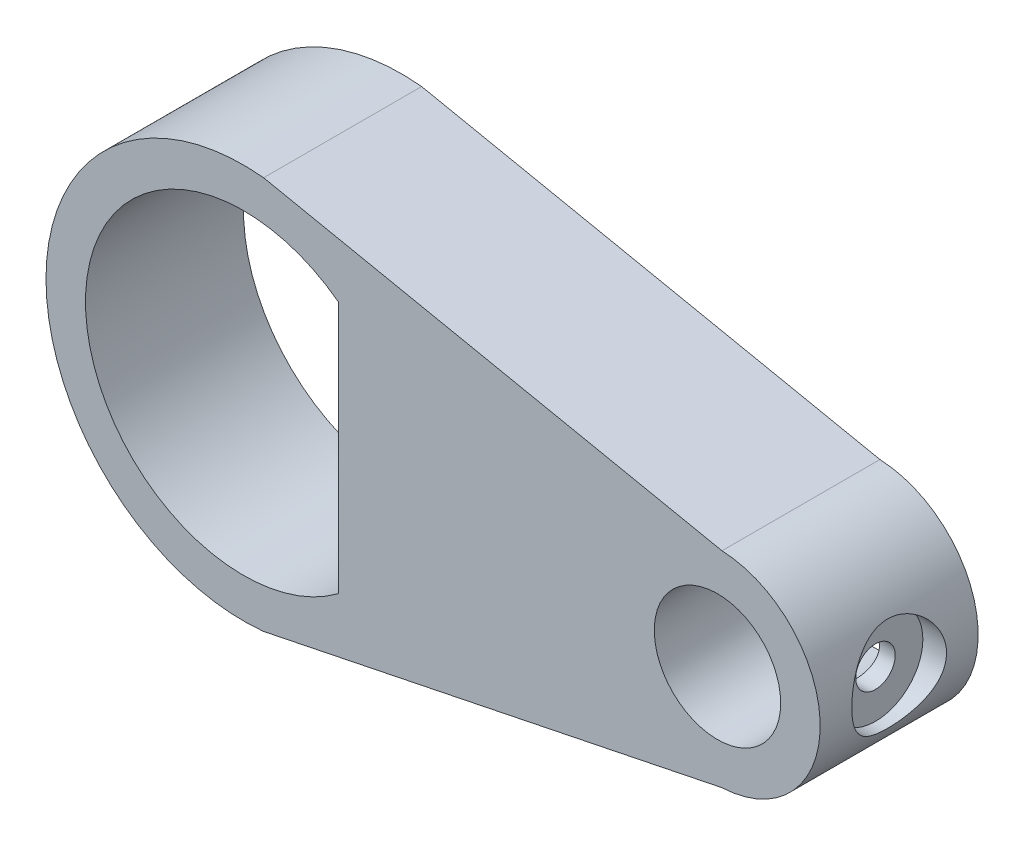
ISO-10303-21;
HEADER;
FILE_DESCRIPTION(('STEP AP214'),'2;1');
FILE_NAME('part.step','',(''),(''),'','','');
FILE_SCHEMA(('AUTOMOTIVE_DESIGN { 1 0 10303 214 1 1 1 1 }'));
ENDSEC;
DATA;
#1=APPLICATION_CONTEXT('core data for automotive mechanical design processes');
#2=APPLICATION_PROTOCOL_DEFINITION('international standard','automotive_design',2000,#1);
#3=PRODUCT_CONTEXT('',#1,'mechanical');
#4=PRODUCT('Part','Part','',(#3));
#5=PRODUCT_RELATED_PRODUCT_CATEGORY('part','',(#4));
#6=PRODUCT_DEFINITION_FORMATION('','',#4);
#7=PRODUCT_DEFINITION_CONTEXT('part definition',#1,'design');
#8=PRODUCT_DEFINITION('design','',#6,#7);
#9=PRODUCT_DEFINITION_SHAPE('','',#8);
#10=(LENGTH_UNIT() NAMED_UNIT(*) SI_UNIT(.MILLI.,.METRE.));
#11=(NAMED_UNIT(*) PLANE_ANGLE_UNIT() SI_UNIT($,.RADIAN.));
#12=(NAMED_UNIT(*) SI_UNIT($,.STERADIAN.) SOLID_ANGLE_UNIT());
#13=UNCERTAINTY_MEASURE_WITH_UNIT(LENGTH_MEASURE(1.E-05),#10,'distance_accuracy_value','');
#14=(GEOMETRIC_REPRESENTATION_CONTEXT(3) GLOBAL_UNCERTAINTY_ASSIGNED_CONTEXT((#13)) GLOBAL_UNIT_ASSIGNED_CONTEXT((#10,
#11,#12)) REPRESENTATION_CONTEXT('',''));
#15=CARTESIAN_POINT('',(0.,0.,0.));
#16=DIRECTION('',(0.,0.,1.));
#17=DIRECTION('',(1.,0.,0.));
#18=AXIS2_PLACEMENT_3D('',#15,#16,#17);
#19=CARTESIAN_POINT('',(15.,0.,5.));
#20=DIRECTION('',(1.,0.,0.));
#21=DIRECTION('',(0.,0.,-1.));
#22=AXIS2_PLACEMENT_3D('',#19,#20,#21);
#23=CYLINDRICAL_SURFACE('',#22,1.25);
#24=CARTESIAN_POINT('',(19.,0.,3.75));
#25=CARTESIAN_POINT('',(18.9999996587799,-0.0684391851745439,3.75000044658758));
#26=CARTESIAN_POINT('',(18.9982269498484,-0.136883052502857,3.75563922694445));
#27=CARTESIAN_POINT('',(18.9913289408881,-0.271769209588446,3.77798624153924));
#28=CARTESIAN_POINT('',(18.9862028819986,-0.338211042725905,3.79469698136436));
#29=CARTESIAN_POINT('',(18.9731581569791,-0.467128543650804,3.83856937119574));
#30=CARTESIAN_POINT('',(18.9652438149902,-0.529610176985801,3.86571484465297));
#31=CARTESIAN_POINT('',(18.9474396916109,-0.649134802346457,3.92961731767833));
#32=CARTESIAN_POINT('',(18.937549598999,-0.706176935444883,3.96637583178059));
#33=CARTESIAN_POINT('',(18.9165021374028,-0.814965334952278,4.04965599201736));
#34=CARTESIAN_POINT('',(18.9053171592699,-0.866520028156658,4.09642088506107));
#35=CARTESIAN_POINT('',(18.8831004637421,-0.961197382036991,4.19786839241355));
#36=CARTESIAN_POINT('',(18.8720687752346,-1.00431847289869,4.25255247749455));
#37=CARTESIAN_POINT('',(18.8511114469817,-1.08194336483113,4.36994456380808));
#38=CARTESIAN_POINT('',(18.841219883018,-1.11620784150129,4.43281747752722));
#39=CARTESIAN_POINT('',(18.8240780179923,-1.17359741076671,4.56379231498187));
#40=CARTESIAN_POINT('',(18.8168270212869,-1.19672543771944,4.63189285579393));
#41=CARTESIAN_POINT('',(18.806076069845,-1.23048459930033,4.76922807745206));
#42=CARTESIAN_POINT('',(18.8024697292951,-1.24147110007864,4.83836684363885));
#43=CARTESIAN_POINT('',(18.7991005514095,-1.25174555036988,4.97759311891189));
#44=CARTESIAN_POINT('',(18.7993366922733,-1.25103660995772,5.04768037082166));
#45=CARTESIAN_POINT('',(18.8035318907544,-1.23821824732739,5.18387446026898));
#46=CARTESIAN_POINT('',(18.8073434174595,-1.22656057869383,5.25002912586157));
#47=CARTESIAN_POINT('',(18.8180202565249,-1.19290813355626,5.37939215653735));
#48=CARTESIAN_POINT('',(18.8248858934311,-1.1709122584455,5.4426002077088));
#49=CARTESIAN_POINT('',(18.841010440143,-1.11688874681277,5.56535194443264));
#50=CARTESIAN_POINT('',(18.8503028466082,-1.08471925662082,5.62482861069198));
#51=CARTESIAN_POINT('',(18.8702185658007,-1.01136020737848,5.73768776787912));
#52=CARTESIAN_POINT('',(18.8808422239455,-0.97016830521577,5.79106867025371));
#53=CARTESIAN_POINT('',(18.9028152780049,-0.877716954182121,5.89277494341699));
#54=CARTESIAN_POINT('',(18.914175696057,-0.826084570592815,5.94075955777968));
#55=CARTESIAN_POINT('',(18.9359157075958,-0.715364408095528,6.02747189357968));
#56=CARTESIAN_POINT('',(18.9462952283837,-0.656276077349018,6.06619892921921));
#57=CARTESIAN_POINT('',(18.9650129489019,-0.531664610465452,6.13352768860128));
#58=CARTESIAN_POINT('',(18.9733346064821,-0.466094906919277,6.16204813546397));
#59=CARTESIAN_POINT('',(18.9868795582855,-0.330767977782642,6.20755300085157));
#60=CARTESIAN_POINT('',(18.9921037932515,-0.261012030724606,6.2245409222384));
#61=CARTESIAN_POINT('',(18.9987138939501,-0.122185157290342,6.24591804257898));
#62=CARTESIAN_POINT('',(19.0002402289544,-0.0531918487888398,6.25076854359352));
#63=CARTESIAN_POINT('',(18.9996979973098,0.0846303057325872,6.24903377336267));
#64=CARTESIAN_POINT('',(18.9976299558112,0.153459174306508,6.2424501726774));
#65=CARTESIAN_POINT('',(18.9902236376977,0.287219332975854,6.21840440739361));
#66=CARTESIAN_POINT('',(18.9849679311072,0.35220497842095,6.20121673238749));
#67=CARTESIAN_POINT('',(18.9718012137925,0.478351928861368,6.15678564763331));
#68=CARTESIAN_POINT('',(18.963889875142,0.539512760449018,6.12954099597509));
#69=CARTESIAN_POINT('',(18.9459854275957,0.657932406672234,6.0650267834512));
#70=CARTESIAN_POINT('',(18.9359462681821,0.715059739787958,6.02752901250278));
#71=CARTESIAN_POINT('',(18.9149341000289,0.822365850960098,5.94384678988298));
#72=CARTESIAN_POINT('',(18.9039608384586,0.872542738043339,5.89765998225689));
#73=CARTESIAN_POINT('',(18.8817699488525,0.966587462919659,5.79574110994631));
#74=CARTESIAN_POINT('',(18.8705598671445,1.01012652339774,5.73970333625474));
#75=CARTESIAN_POINT('',(18.849619470876,1.08721250244909,5.62087338362926));
#76=CARTESIAN_POINT('',(18.839889132814,1.12075957972524,5.55808131199557));
#77=CARTESIAN_POINT('',(18.8231178236075,1.17670083481141,5.42765482711414));
#78=CARTESIAN_POINT('',(18.8160664646803,1.19913819558886,5.3600403504953));
#79=CARTESIAN_POINT('',(18.8055117094121,1.23222894320964,5.22172750667621));
#80=CARTESIAN_POINT('',(18.8020069630267,1.2428868141461,5.15103032362869));
#81=CARTESIAN_POINT('',(18.7990829271249,1.25179406157541,5.01199591244576));
#82=CARTESIAN_POINT('',(18.7994860468308,1.25058279621957,4.94369654618707));
#83=CARTESIAN_POINT('',(18.8039009047238,1.23708818129474,4.80832541508082));
#84=CARTESIAN_POINT('',(18.8079124745732,1.2248053482256,4.741253593116));
#85=CARTESIAN_POINT('',(18.8189681415811,1.18987729913378,4.61120596039822));
#86=CARTESIAN_POINT('',(18.8259669818347,1.16738642405944,4.54818455890399));
#87=CARTESIAN_POINT('',(18.8421970426135,1.11280227335064,4.42675958646865));
#88=CARTESIAN_POINT('',(18.8514287171652,1.08070704444255,4.36835695792232));
#89=CARTESIAN_POINT('',(18.8715348703158,1.00635675013475,4.25535402955944));
#90=CARTESIAN_POINT('',(18.8824594892244,0.963753335241276,4.20099187049956));
#91=CARTESIAN_POINT('',(18.9044899882173,0.870208996404851,4.1000136718882));
#92=CARTESIAN_POINT('',(18.9155959160679,0.819265842344406,4.053399711009));
#93=CARTESIAN_POINT('',(18.9371727195233,0.708486662823335,3.96771746163701));
#94=CARTESIAN_POINT('',(18.9476110173063,0.648414574487383,3.92894526355003));
#95=CARTESIAN_POINT('',(18.9662676929692,0.522279138013657,3.86210108486056));
#96=CARTESIAN_POINT('',(18.9744869431583,0.456218157795452,3.83402489785817));
#97=CARTESIAN_POINT('',(18.9872065073346,0.32574763537398,3.79140863239153));
#98=CARTESIAN_POINT('',(18.9919624080614,0.261670337112548,3.77592513269466));
#99=CARTESIAN_POINT('',(18.9983590034049,0.13172989544025,3.75522164003229));
#100=CARTESIAN_POINT('',(19.0000003283964,0.0658671161396773,3.749999570196));
#101=CARTESIAN_POINT('',(19.,0.,3.75));
#102=B_SPLINE_CURVE_WITH_KNOTS('',3,(#24,#25,#26,#27,#28,#29,#30,#31,#32,#33,#34,#35,#36,#37,
#38,#39,#40,#41,#42,#43,#44,#45,#46,#47,#48,#49,#50,#51,#52,#53,#54,#55,#56,#57,#58,#59,#60,#61,
#62,#63,#64,#65,#66,#67,#68,#69,#70,#71,#72,#73,#74,#75,#76,#77,#78,#79,#80,#81,#82,#83,#84,#85,
#86,#87,#88,#89,#90,#91,#92,#93,#94,#95,#96,#97,#98,#99,#100,#101),.UNSPECIFIED.,.T.,.F.,(4,2,2,
2,2,2,2,2,2,2,2,2,2,2,2,2,2,2,2,2,2,2,2,2,2,2,2,2,2,2,2,2,2,2,2,2,2,2,4),(0.,0.20507544943251,
0.410197323349067,0.615002479202436,0.819839921558391,1.03037822195158,1.24095567431276,
1.45673771247494,1.67246286279527,1.8816915016721,2.09086450295138,2.29176917422169,
2.49269519979063,2.69655642720545,2.90047066010359,3.113667472796,3.32688007413303,
3.5417546068977,3.75656384494554,3.96307568548238,4.16955735649363,4.37090626722872,
4.572280050345,4.77856324738343,4.98490245709259,5.1994177871314,5.41392970983712,
5.62760115751031,5.84119123892431,6.04512203476054,6.24904331751085,6.44997913396671,
6.65095584330174,6.85979514006362,7.06869037373341,7.28440668126413,7.50003806666338,
7.69744636651541,7.89481470763048),.UNSPECIFIED.);
#103=CARTESIAN_POINT('',(19.,0.,3.75));
#104=VERTEX_POINT('',#103);
#105=EDGE_CURVE('E117',#104,#104,#102,.T.);
#106=ORIENTED_EDGE('',*,*,#105,.T.);
#107=EDGE_LOOP('',(#106));
#108=FACE_BOUND('',#107,.T.);
#109=CARTESIAN_POINT('',(20.,0.,5.));
#110=DIRECTION('',(1.,0.,0.));
#111=DIRECTION('',(0.,0.,-1.));
#112=AXIS2_PLACEMENT_3D('',#109,#110,#111);
#113=CIRCLE('',#112,1.25);
#114=CARTESIAN_POINT('',(20.,0.,3.75));
#115=VERTEX_POINT('',#114);
#116=EDGE_CURVE('E158',#115,#115,#113,.F.);
#117=ORIENTED_EDGE('',*,*,#116,.F.);
#118=EDGE_LOOP('',(#117));
#119=FACE_BOUND('',#118,.T.);
#120=ADVANCED_FACE('F41',(#108,#119),#23,.F.);
#121=CARTESIAN_POINT('',(15.,0.,10.));
#122=DIRECTION('',(0.,0.,1.));
#123=DIRECTION('',(1.,0.,0.));
#124=AXIS2_PLACEMENT_3D('',#121,#122,#123);
#125=PLANE('',#124);
#126=CARTESIAN_POINT('',(15.,0.,10.));
#127=DIRECTION('',(0.,0.,1.));
#128=DIRECTION('',(1.,0.,0.));
#129=AXIS2_PLACEMENT_3D('',#126,#127,#128);
#130=CIRCLE('',#129,6.5);
#131=CARTESIAN_POINT('',(15.2835847646396,-6.49381087507668,10.));
#132=VERTEX_POINT('',#131);
#133=CARTESIAN_POINT('',(15.2835847646396,6.4938108750767,10.));
#134=VERTEX_POINT('',#133);
#135=EDGE_CURVE('E127',#132,#134,#130,.T.);
#136=ORIENTED_EDGE('',*,*,#135,.T.);
#137=DIRECTION('',(-0.979667043647879,0.200630216044904,0.));
#138=VECTOR('',#137,1.);
#139=CARTESIAN_POINT('',(15.2835847646396,6.4938108750767,10.));
#140=LINE('',#139,#138);
#141=CARTESIAN_POINT('',(-13.7269699731537,12.4350068174789,10.));
#142=VERTEX_POINT('',#141);
#143=EDGE_CURVE('E130',#134,#142,#140,.T.);
#144=ORIENTED_EDGE('',*,*,#143,.T.);
#145=CARTESIAN_POINT('',(-15.,0.,10.));
#146=DIRECTION('',(0.,0.,1.));
#147=DIRECTION('',(1.,0.,0.));
#148=AXIS2_PLACEMENT_3D('',#145,#146,#147);
#149=CIRCLE('',#148,12.5);
#150=CARTESIAN_POINT('',(-13.7269699731537,-12.4350068174789,10.));
#151=VERTEX_POINT('',#150);
#152=EDGE_CURVE('E133',#142,#151,#149,.T.);
#153=ORIENTED_EDGE('',*,*,#152,.T.);
#154=DIRECTION('',(0.979667043647879,0.200630216044904,0.));
#155=VECTOR('',#154,1.);
#156=CARTESIAN_POINT('',(15.2835847646396,-6.49381087507668,10.));
#157=LINE('',#156,#155);
#158=EDGE_CURVE('E135',#151,#132,#157,.T.);
#159=ORIENTED_EDGE('',*,*,#158,.T.);
#160=EDGE_LOOP('',(#136,#144,#153,#159));
#161=FACE_BOUND('',#160,.T.);
#162=CARTESIAN_POINT('',(15.,0.,10.));
#163=DIRECTION('',(0.,0.,1.));
#164=DIRECTION('',(1.,0.,0.));
#165=AXIS2_PLACEMENT_3D('',#162,#163,#164);
#166=CIRCLE('',#165,4.);
#167=CARTESIAN_POINT('',(19.,0.,10.));
#168=VERTEX_POINT('',#167);
#169=EDGE_CURVE('E121',#168,#168,#166,.T.);
#170=ORIENTED_EDGE('',*,*,#169,.F.);
#171=EDGE_LOOP('',(#170));
#172=FACE_BOUND('',#171,.T.);
#173=DIRECTION('',(0.,1.,0.));
#174=VECTOR('',#173,1.);
#175=CARTESIAN_POINT('',(-9.,-8.,10.));
#176=LINE('',#175,#174);
#177=CARTESIAN_POINT('',(-9.,-8.,10.));
#178=VERTEX_POINT('',#177);
#179=CARTESIAN_POINT('',(-9.,8.,10.));
#180=VERTEX_POINT('',#179);
#181=EDGE_CURVE('E100',#178,#180,#176,.T.);
#182=ORIENTED_EDGE('',*,*,#181,.F.);
#183=CARTESIAN_POINT('',(-15.,0.,10.));
#184=DIRECTION('',(0.,0.,1.));
#185=DIRECTION('',(1.,0.,0.));
#186=AXIS2_PLACEMENT_3D('',#183,#184,#185);
#187=CIRCLE('',#186,10.);
#188=EDGE_CURVE('E106',#180,#178,#187,.T.);
#189=ORIENTED_EDGE('',*,*,#188,.F.);
#190=EDGE_LOOP('',(#182,#189));
#191=FACE_BOUND('',#190,.T.);
#192=ADVANCED_FACE('F110',(#161,#172,#191),#125,.T.);
#193=CARTESIAN_POINT('',(15.,0.,0.));
#194=DIRECTION('',(0.,0.,1.));
#195=DIRECTION('',(1.,0.,0.));
#196=AXIS2_PLACEMENT_3D('',#193,#194,#195);
#197=PLANE('',#196);
#198=CARTESIAN_POINT('',(15.,0.,0.));
#199=DIRECTION('',(0.,0.,1.));
#200=DIRECTION('',(1.,0.,0.));
#201=AXIS2_PLACEMENT_3D('',#198,#199,#200);
#202=CIRCLE('',#201,4.);
#203=CARTESIAN_POINT('',(19.,0.,0.));
#204=VERTEX_POINT('',#203);
#205=EDGE_CURVE('E120',#204,#204,#202,.T.);
#206=ORIENTED_EDGE('',*,*,#205,.T.);
#207=EDGE_LOOP('',(#206));
#208=FACE_BOUND('',#207,.T.);
#209=CARTESIAN_POINT('',(15.,0.,0.));
#210=DIRECTION('',(0.,0.,1.));
#211=DIRECTION('',(1.,0.,0.));
#212=AXIS2_PLACEMENT_3D('',#209,#210,#211);
#213=CIRCLE('',#212,6.5);
#214=CARTESIAN_POINT('',(15.2835847646396,-6.49381087507668,0.));
#215=VERTEX_POINT('',#214);
#216=CARTESIAN_POINT('',(15.2835847646396,6.4938108750767,0.));
#217=VERTEX_POINT('',#216);
#218=EDGE_CURVE('E124',#215,#217,#213,.T.);
#219=ORIENTED_EDGE('',*,*,#218,.F.);
#220=DIRECTION('',(0.979667043647879,0.200630216044904,0.));
#221=VECTOR('',#220,1.);
#222=CARTESIAN_POINT('',(15.2835847646396,-6.49381087507668,0.));
#223=LINE('',#222,#221);
#224=CARTESIAN_POINT('',(-13.7269699731537,-12.4350068174789,0.));
#225=VERTEX_POINT('',#224);
#226=EDGE_CURVE('E131',#225,#215,#223,.T.);
#227=ORIENTED_EDGE('',*,*,#226,.F.);
#228=CARTESIAN_POINT('',(-15.,0.,0.));
#229=DIRECTION('',(0.,0.,1.));
#230=DIRECTION('',(1.,0.,0.));
#231=AXIS2_PLACEMENT_3D('',#228,#229,#230);
#232=CIRCLE('',#231,12.5);
#233=CARTESIAN_POINT('',(-13.7269699731537,12.4350068174789,0.));
#234=VERTEX_POINT('',#233);
#235=EDGE_CURVE('E142',#234,#225,#232,.T.);
#236=ORIENTED_EDGE('',*,*,#235,.F.);
#237=DIRECTION('',(-0.979667043647879,0.200630216044904,0.));
#238=VECTOR('',#237,1.);
#239=CARTESIAN_POINT('',(15.2835847646396,6.4938108750767,0.));
#240=LINE('',#239,#238);
#241=EDGE_CURVE('E140',#217,#234,#240,.T.);
#242=ORIENTED_EDGE('',*,*,#241,.F.);
#243=EDGE_LOOP('',(#219,#227,#236,#242));
#244=FACE_BOUND('',#243,.T.);
#245=CARTESIAN_POINT('',(-15.,0.,0.));
#246=DIRECTION('',(0.,0.,1.));
#247=DIRECTION('',(1.,0.,0.));
#248=AXIS2_PLACEMENT_3D('',#245,#246,#247);
#249=CIRCLE('',#248,10.);
#250=CARTESIAN_POINT('',(-9.,8.,0.));
#251=VERTEX_POINT('',#250);
#252=CARTESIAN_POINT('',(-9.,-8.,0.));
#253=VERTEX_POINT('',#252);
#254=EDGE_CURVE('E70',#251,#253,#249,.T.);
#255=ORIENTED_EDGE('',*,*,#254,.T.);
#256=DIRECTION('',(0.,1.,0.));
#257=VECTOR('',#256,1.);
#258=CARTESIAN_POINT('',(-9.,-8.,0.));
#259=LINE('',#258,#257);
#260=EDGE_CURVE('E111',#253,#251,#259,.T.);
#261=ORIENTED_EDGE('',*,*,#260,.T.);
#262=EDGE_LOOP('',(#255,#261));
#263=FACE_BOUND('',#262,.T.);
#264=ADVANCED_FACE('F189',(#208,#244,#263),#197,.F.);
#265=CARTESIAN_POINT('',(15.,0.,10.));
#266=DIRECTION('',(0.,0.,-1.));
#267=DIRECTION('',(-1.,0.,0.));
#268=AXIS2_PLACEMENT_3D('',#265,#266,#267);
#269=CYLINDRICAL_SURFACE('',#268,6.5);
#270=CARTESIAN_POINT('',(21.5,0.,2.));
#271=CARTESIAN_POINT('',(21.4999919359845,-0.159129740023637,2.00000982526993));
#272=CARTESIAN_POINT('',(21.4940912944936,-0.318496713154489,2.0127366449908));
#273=CARTESIAN_POINT('',(21.4710698563111,-0.632606247293035,2.06312598595516));
#274=CARTESIAN_POINT('',(21.4539237004447,-0.787337527979159,2.10084486747418));
#275=CARTESIAN_POINT('',(21.4102251606775,-1.08714223490984,2.19947742216789));
#276=CARTESIAN_POINT('',(21.3837073426934,-1.23224885516992,2.2603059201352));
#277=CARTESIAN_POINT('',(21.3237685926566,-1.51002307569929,2.40303364017514));
#278=CARTESIAN_POINT('',(21.2903489140542,-1.64269292826373,2.48492903694093));
#279=CARTESIAN_POINT('',(21.2176607042964,-1.89986895880032,2.67251741618932));
#280=CARTESIAN_POINT('',(21.178174212621,-2.02355169196679,2.77925382385062));
#281=CARTESIAN_POINT('',(21.0986201220495,-2.25199750098769,3.01127125320302));
#282=CARTESIAN_POINT('',(21.0585521669936,-2.35674840232589,3.13656411446639));
#283=CARTESIAN_POINT('',(20.9794820200059,-2.55097774210912,3.41172188724498));
#284=CARTESIAN_POINT('',(20.9407087023437,-2.63906569563089,3.56264139659178));
#285=CARTESIAN_POINT('',(20.872178791052,-2.7882438591157,3.87917349381369));
#286=CARTESIAN_POINT('',(20.8424165573445,-2.84935096753515,4.04477680675279));
#287=CARTESIAN_POINT('',(20.7976914278581,-2.93924908147225,4.37655094634916));
#288=CARTESIAN_POINT('',(20.7820031468125,-2.96963584911131,4.5421872391914));
#289=CARTESIAN_POINT('',(20.7651813338498,-3.00217547679102,4.87689145859441));
#290=CARTESIAN_POINT('',(20.7640368547307,-3.00434957269561,5.04595670813692));
#291=CARTESIAN_POINT('',(20.7758328466721,-2.98158560174146,5.36494863123603));
#292=CARTESIAN_POINT('',(20.7874023973502,-2.95928670198316,5.51512557775822));
#293=CARTESIAN_POINT('',(20.8209613552565,-2.89271218555569,5.80930223237309));
#294=CARTESIAN_POINT('',(20.8429533571526,-2.84843109629297,5.95330039251747));
#295=CARTESIAN_POINT('',(20.895389127545,-2.73827780955064,6.23500856821001));
#296=CARTESIAN_POINT('',(20.9260152646282,-2.67193346170893,6.37249845474722));
#297=CARTESIAN_POINT('',(20.9922503885018,-2.51988161713396,6.6350015378993));
#298=CARTESIAN_POINT('',(21.0278615343194,-2.43416572056869,6.76000928804312));
#299=CARTESIAN_POINT('',(21.1046280894897,-2.23518179489322,7.00794081382322));
#300=CARTESIAN_POINT('',(21.1459712010482,-2.11995698607915,7.12924105731678));
#301=CARTESIAN_POINT('',(21.2264272302949,-1.8705012656823,7.35141100972993));
#302=CARTESIAN_POINT('',(21.2655393627323,-1.73626371927504,7.45227355656814));
#303=CARTESIAN_POINT('',(21.338776755616,-1.44669684750736,7.63386381261296));
#304=CARTESIAN_POINT('',(21.3726861934808,-1.29080393285876,7.71378661551647));
#305=CARTESIAN_POINT('',(21.4299563020612,-0.965818596709177,7.84567872109861));
#306=CARTESIAN_POINT('',(21.4533241437761,-0.796735240219266,7.89766703103856));
#307=CARTESIAN_POINT('',(21.4854436081495,-0.463602839452804,7.96848315365418));
#308=CARTESIAN_POINT('',(21.4951489826316,-0.300107360641256,7.98948041513787));
#309=CARTESIAN_POINT('',(21.502010263252,0.0283509158459187,8.00436212986789));
#310=CARTESIAN_POINT('',(21.4991708926606,0.19331313792917,7.99825678761556));
#311=CARTESIAN_POINT('',(21.4818539016646,0.50889545770286,7.96051898276379));
#312=CARTESIAN_POINT('',(21.4681294309682,0.659759631845763,7.93053796736406));
#313=CARTESIAN_POINT('',(21.4313094600099,0.954079363496146,7.84834805846373));
#314=CARTESIAN_POINT('',(21.4082128529188,1.09753404370171,7.79613653955222));
#315=CARTESIAN_POINT('',(21.3539069163044,1.37801009985268,7.66936468744135));
#316=CARTESIAN_POINT('',(21.3224694381106,1.51469681576858,7.59416500535777));
#317=CARTESIAN_POINT('',(21.2546717973536,1.77399872636956,7.42424925135131));
#318=CARTESIAN_POINT('',(21.2183094741333,1.89660770091261,7.3295246037465));
#319=CARTESIAN_POINT('',(21.1406048180373,2.13543211180621,7.11376596284327));
#320=CARTESIAN_POINT('',(21.0991033473287,2.25018643549152,6.99116833015605));
#321=CARTESIAN_POINT('',(21.0183486222896,2.45803592830905,6.72805768934439));
#322=CARTESIAN_POINT('',(20.9790963799476,2.55112140483568,6.5875367073336));
#323=CARTESIAN_POINT('',(20.9063066336542,2.71549078439324,6.28697555495703));
#324=CARTESIAN_POINT('',(20.872977843945,2.7860302646306,6.12647361658381));
#325=CARTESIAN_POINT('',(20.8183670212564,2.89837428577096,5.7938245535228));
#326=CARTESIAN_POINT('',(20.7970720188129,2.94020977297888,5.62169019068403));
#327=CARTESIAN_POINT('',(20.7712349061181,2.99058122218972,5.28713566251482));
#328=CARTESIAN_POINT('',(20.7653706458863,3.00174910461876,5.12521411981994));
#329=CARTESIAN_POINT('',(20.7674228900574,2.99780698335845,4.80180123981902));
#330=CARTESIAN_POINT('',(20.775335765934,2.98270389873475,4.64030980045398));
#331=CARTESIAN_POINT('',(20.8027342831334,2.92900530543887,4.33410982974653));
#332=CARTESIAN_POINT('',(20.8213734731172,2.89212339406144,4.1890166989356));
#333=CARTESIAN_POINT('',(20.8672809950762,2.7978112907387,3.90713370334624));
#334=CARTESIAN_POINT('',(20.8945518768675,2.74037502634773,3.77034630634394));
#335=CARTESIAN_POINT('',(20.9568625035164,2.60228329976768,3.49906817389591));
#336=CARTESIAN_POINT('',(20.9922955105788,2.52034815272259,3.36532149910351));
#337=CARTESIAN_POINT('',(21.0660875979538,2.337161167601,3.11266157641973));
#338=CARTESIAN_POINT('',(21.1044480086842,2.2359005149025,2.99375513845117));
#339=CARTESIAN_POINT('',(21.1842432412337,2.00534865465994,2.76218590845958));
#340=CARTESIAN_POINT('',(21.2256140727745,1.87428881140545,2.651256086212));
#341=CARTESIAN_POINT('',(21.3032082959526,1.59393984404993,2.45268530097589));
#342=CARTESIAN_POINT('',(21.3394292656257,1.44464220373001,2.36505527906713));
#343=CARTESIAN_POINT('',(21.3867760406083,1.21054873877768,2.25372849541374));
#344=CARTESIAN_POINT('',(21.4013627200665,1.13106523731987,2.22003970976106));
#345=CARTESIAN_POINT('',(21.427871901841,0.96911071586302,2.15952783547615));
#346=CARTESIAN_POINT('',(21.4397956944163,0.886641165315954,2.13270142087198));
#347=CARTESIAN_POINT('',(21.4605996915318,0.719534074866301,2.08627781107369));
#348=CARTESIAN_POINT('',(21.4694869949826,0.634902095723698,2.06666374605266));
#349=CARTESIAN_POINT('',(21.4839820734272,0.464024245926378,2.03483128196764));
#350=CARTESIAN_POINT('',(21.4895920451148,0.377779496367209,2.02260792894611));
#351=CARTESIAN_POINT('',(21.4956451186612,0.242771973816684,2.009444578876));
#352=CARTESIAN_POINT('',(21.4972760439663,0.194301346625723,2.0059052184736));
#353=CARTESIAN_POINT('',(21.4994547264692,0.0972278648476555,2.00118140662803));
#354=CARTESIAN_POINT('',(21.5000024641077,0.048625007888716,1.99999699770874));
#355=CARTESIAN_POINT('',(21.5,0.,2.));
#356=B_SPLINE_CURVE_WITH_KNOTS('',3,(#270,#271,#272,#273,#274,#275,#276,#277,#278,#279,#280,
#281,#282,#283,#284,#285,#286,#287,#288,#289,#290,#291,#292,#293,#294,#295,#296,#297,#298,#299,
#300,#301,#302,#303,#304,#305,#306,#307,#308,#309,#310,#311,#312,#313,#314,#315,#316,#317,#318,
#319,#320,#321,#322,#323,#324,#325,#326,#327,#328,#329,#330,#331,#332,#333,#334,#335,#336,#337,
#338,#339,#340,#341,#342,#343,#344,#345,#346,#347,#348,#349,#350,#351,#352,#353,#354,#355),
.UNSPECIFIED.,.T.,.F.,(4,2,2,2,2,2,2,2,2,2,2,2,2,2,2,2,2,2,2,2,2,2,2,2,2,2,2,2,2,2,2,2,2,2,2,2,
2,2,2,2,2,2,4),(0.,0.477200204967823,0.955480236490606,1.43201430730961,1.90846191054199,
2.41054736697623,2.91295456010355,3.44723474488289,3.98117982667258,4.4856906195183,
4.98982164171928,5.44449010747481,5.89927182239017,6.36448978686469,6.82990986610931,
7.34463261353582,7.85953542698887,8.39201594880152,8.92413369853156,9.41686930204894,
9.90941939960484,10.3705828952427,10.8318008691632,11.3072372627792,11.7828829224499,
12.2995111125967,12.8163699514819,13.3488589877167,13.8807730317792,14.3653541002028,
14.8498075623387,15.3004415694755,15.7512088190771,16.2316520984592,16.7123150404513,
17.2397422544707,17.767416701186,18.0297750672698,18.2920060346837,18.553619677245,
18.815057766518,18.960872400173,19.106689666811),.UNSPECIFIED.);
#357=CARTESIAN_POINT('',(21.5,0.,2.));
#358=VERTEX_POINT('',#357);
#359=EDGE_CURVE('E46',#358,#358,#356,.T.);
#360=ORIENTED_EDGE('',*,*,#359,.T.);
#361=EDGE_LOOP('',(#360));
#362=FACE_BOUND('',#361,.T.);
#363=ORIENTED_EDGE('',*,*,#218,.T.);
#364=DIRECTION('',(0.,0.,-1.));
#365=VECTOR('',#364,1.);
#366=CARTESIAN_POINT('',(15.2835847646396,6.4938108750767,10.));
#367=LINE('',#366,#365);
#368=EDGE_CURVE('E11',#134,#217,#367,.T.);
#369=ORIENTED_EDGE('',*,*,#368,.F.);
#370=ORIENTED_EDGE('',*,*,#135,.F.);
#371=DIRECTION('',(0.,0.,-1.));
#372=VECTOR('',#371,1.);
#373=CARTESIAN_POINT('',(15.2835847646396,-6.49381087507668,10.));
#374=LINE('',#373,#372);
#375=EDGE_CURVE('E137',#132,#215,#374,.T.);
#376=ORIENTED_EDGE('',*,*,#375,.T.);
#377=EDGE_LOOP('',(#363,#369,#370,#376));
#378=FACE_BOUND('',#377,.T.);
#379=ADVANCED_FACE('F43',(#362,#378),#269,.T.);
#380=CARTESIAN_POINT('',(15.2835847646396,6.4938108750767,10.));
#381=DIRECTION('',(-0.200630216044904,-0.979667043647879,0.));
#382=DIRECTION('',(0.979667043647879,-0.200630216044904,0.));
#383=AXIS2_PLACEMENT_3D('',#380,#381,#382);
#384=PLANE('',#383);
#385=ORIENTED_EDGE('',*,*,#241,.T.);
#386=DIRECTION('',(0.,0.,-1.));
#387=VECTOR('',#386,1.);
#388=CARTESIAN_POINT('',(-13.7269699731537,12.4350068174789,10.));
#389=LINE('',#388,#387);
#390=EDGE_CURVE('E55',#142,#234,#389,.T.);
#391=ORIENTED_EDGE('',*,*,#390,.F.);
#392=ORIENTED_EDGE('',*,*,#143,.F.);
#393=ORIENTED_EDGE('',*,*,#368,.T.);
#394=EDGE_LOOP('',(#385,#391,#392,#393));
#395=FACE_BOUND('',#394,.T.);
#396=ADVANCED_FACE('F207',(#395),#384,.F.);
#397=CARTESIAN_POINT('',(-15.,0.,10.));
#398=DIRECTION('',(0.,0.,-1.));
#399=DIRECTION('',(-1.,0.,0.));
#400=AXIS2_PLACEMENT_3D('',#397,#398,#399);
#401=CYLINDRICAL_SURFACE('',#400,12.5);
#402=ORIENTED_EDGE('',*,*,#235,.T.);
#403=DIRECTION('',(0.,0.,-1.));
#404=VECTOR('',#403,1.);
#405=CARTESIAN_POINT('',(-13.7269699731537,-12.4350068174789,10.));
#406=LINE('',#405,#404);
#407=EDGE_CURVE('E147',#151,#225,#406,.T.);
#408=ORIENTED_EDGE('',*,*,#407,.F.);
#409=ORIENTED_EDGE('',*,*,#152,.F.);
#410=ORIENTED_EDGE('',*,*,#390,.T.);
#411=EDGE_LOOP('',(#402,#408,#409,#410));
#412=FACE_BOUND('',#411,.T.);
#413=ADVANCED_FACE('F180',(#412),#401,.T.);
#414=CARTESIAN_POINT('',(15.2835847646396,-6.49381087507668,10.));
#415=DIRECTION('',(-0.200630216044904,0.979667043647879,0.));
#416=DIRECTION('',(-0.979667043647879,-0.200630216044904,0.));
#417=AXIS2_PLACEMENT_3D('',#414,#415,#416);
#418=PLANE('',#417);
#419=ORIENTED_EDGE('',*,*,#226,.T.);
#420=ORIENTED_EDGE('',*,*,#375,.F.);
#421=ORIENTED_EDGE('',*,*,#158,.F.);
#422=ORIENTED_EDGE('',*,*,#407,.T.);
#423=EDGE_LOOP('',(#419,#420,#421,#422));
#424=FACE_BOUND('',#423,.T.);
#425=ADVANCED_FACE('F175',(#424),#418,.F.);
#426=CARTESIAN_POINT('',(15.,0.,10.));
#427=DIRECTION('',(0.,0.,-1.));
#428=DIRECTION('',(-1.,0.,0.));
#429=AXIS2_PLACEMENT_3D('',#426,#427,#428);
#430=CYLINDRICAL_SURFACE('',#429,4.);
#431=ORIENTED_EDGE('',*,*,#105,.F.);
#432=EDGE_LOOP('',(#431));
#433=FACE_BOUND('',#432,.T.);
#434=ORIENTED_EDGE('',*,*,#169,.T.);
#435=EDGE_LOOP('',(#434));
#436=FACE_BOUND('',#435,.T.);
#437=ORIENTED_EDGE('',*,*,#205,.F.);
#438=EDGE_LOOP('',(#437));
#439=FACE_BOUND('',#438,.T.);
#440=ADVANCED_FACE('F159',(#433,#436,#439),#430,.F.);
#441=CARTESIAN_POINT('',(-15.,0.,10.));
#442=DIRECTION('',(0.,0.,-1.));
#443=DIRECTION('',(-1.,0.,0.));
#444=AXIS2_PLACEMENT_3D('',#441,#442,#443);
#445=CYLINDRICAL_SURFACE('',#444,10.);
#446=ORIENTED_EDGE('',*,*,#254,.F.);
#447=DIRECTION('',(0.,0.,-1.));
#448=VECTOR('',#447,1.);
#449=CARTESIAN_POINT('',(-9.,8.,10.));
#450=LINE('',#449,#448);
#451=EDGE_CURVE('E102',#180,#251,#450,.T.);
#452=ORIENTED_EDGE('',*,*,#451,.F.);
#453=ORIENTED_EDGE('',*,*,#188,.T.);
#454=DIRECTION('',(0.,0.,-1.));
#455=VECTOR('',#454,1.);
#456=CARTESIAN_POINT('',(-9.,-8.,10.));
#457=LINE('',#456,#455);
#458=EDGE_CURVE('E63',#178,#253,#457,.T.);
#459=ORIENTED_EDGE('',*,*,#458,.T.);
#460=EDGE_LOOP('',(#446,#452,#453,#459));
#461=FACE_BOUND('',#460,.T.);
#462=ADVANCED_FACE('F108',(#461),#445,.F.);
#463=CARTESIAN_POINT('',(-9.,-8.,10.));
#464=DIRECTION('',(-1.,0.,0.));
#465=DIRECTION('',(0.,0.,1.));
#466=AXIS2_PLACEMENT_3D('',#463,#464,#465);
#467=PLANE('',#466);
#468=ORIENTED_EDGE('',*,*,#260,.F.);
#469=ORIENTED_EDGE('',*,*,#458,.F.);
#470=ORIENTED_EDGE('',*,*,#181,.T.);
#471=ORIENTED_EDGE('',*,*,#451,.T.);
#472=EDGE_LOOP('',(#468,#469,#470,#471));
#473=FACE_BOUND('',#472,.T.);
#474=ADVANCED_FACE('F101',(#473),#467,.T.);
#475=CARTESIAN_POINT('',(20.,0.,5.));
#476=DIRECTION('',(1.,0.,0.));
#477=DIRECTION('',(0.,0.,-1.));
#478=AXIS2_PLACEMENT_3D('',#475,#476,#477);
#479=CYLINDRICAL_SURFACE('',#478,3.);
#480=CARTESIAN_POINT('',(20.,0.,5.));
#481=DIRECTION('',(1.,0.,0.));
#482=DIRECTION('',(0.,0.,-1.));
#483=AXIS2_PLACEMENT_3D('',#480,#481,#482);
#484=CIRCLE('',#483,3.);
#485=CARTESIAN_POINT('',(20.,0.,2.));
#486=VERTEX_POINT('',#485);
#487=EDGE_CURVE('E115',#486,#486,#484,.T.);
#488=ORIENTED_EDGE('',*,*,#487,.F.);
#489=EDGE_LOOP('',(#488));
#490=FACE_BOUND('',#489,.T.);
#491=ORIENTED_EDGE('',*,*,#359,.F.);
#492=EDGE_LOOP('',(#491));
#493=FACE_BOUND('',#492,.T.);
#494=ADVANCED_FACE('F167',(#490,#493),#479,.F.);
#495=CARTESIAN_POINT('',(20.,0.,5.));
#496=DIRECTION('',(1.,0.,0.));
#497=DIRECTION('',(0.,0.,-1.));
#498=AXIS2_PLACEMENT_3D('',#495,#496,#497);
#499=PLANE('',#498);
#500=ORIENTED_EDGE('',*,*,#487,.T.);
#501=EDGE_LOOP('',(#500));
#502=FACE_BOUND('',#501,.T.);
#503=ORIENTED_EDGE('',*,*,#116,.T.);
#504=EDGE_LOOP('',(#503));
#505=FACE_BOUND('',#504,.T.);
#506=ADVANCED_FACE('F231',(#502,#505),#499,.T.);
#507=CLOSED_SHELL('',(#120,#192,#264,#379,#396,#413,#425,#440,#462,#474,#494,#506));
#508=MANIFOLD_SOLID_BREP('B2',#507);
#509=ADVANCED_BREP_SHAPE_REPRESENTATION('',(#18,#508),#14);
#510=SHAPE_DEFINITION_REPRESENTATION(#9,#509);
ENDSEC;
END-ISO-10303-21;
